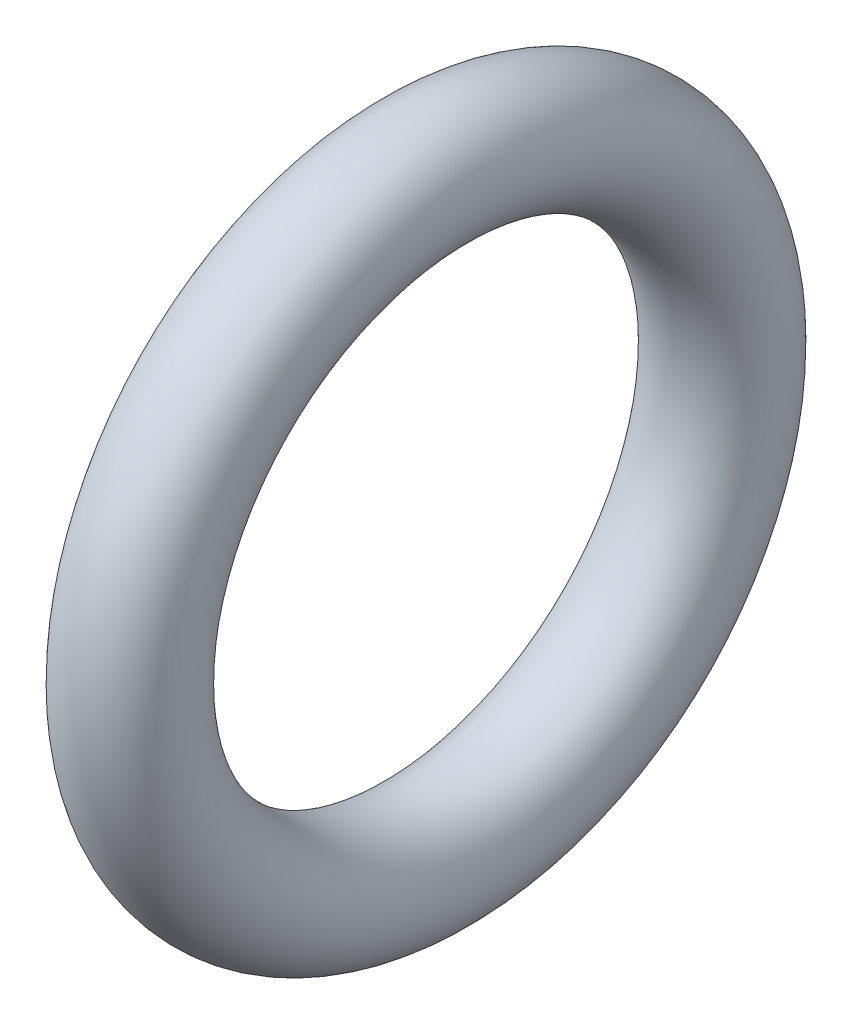
ISO-10303-21;
HEADER;
FILE_DESCRIPTION(('STEP AP214'),'2;1');
FILE_NAME('part.step','',(''),(''),'','','');
FILE_SCHEMA(('AUTOMOTIVE_DESIGN { 1 0 10303 214 1 1 1 1 }'));
ENDSEC;
DATA;
#1=APPLICATION_CONTEXT('core data for automotive mechanical design processes');
#2=APPLICATION_PROTOCOL_DEFINITION('international standard','automotive_design',2000,#1);
#3=PRODUCT_CONTEXT('',#1,'mechanical');
#4=PRODUCT('Part','Part','',(#3));
#5=PRODUCT_RELATED_PRODUCT_CATEGORY('part','',(#4));
#6=PRODUCT_DEFINITION_FORMATION('','',#4);
#7=PRODUCT_DEFINITION_CONTEXT('part definition',#1,'design');
#8=PRODUCT_DEFINITION('design','',#6,#7);
#9=PRODUCT_DEFINITION_SHAPE('','',#8);
#10=(LENGTH_UNIT() NAMED_UNIT(*) SI_UNIT(.MILLI.,.METRE.));
#11=(NAMED_UNIT(*) PLANE_ANGLE_UNIT() SI_UNIT($,.RADIAN.));
#12=(NAMED_UNIT(*) SI_UNIT($,.STERADIAN.) SOLID_ANGLE_UNIT());
#13=UNCERTAINTY_MEASURE_WITH_UNIT(LENGTH_MEASURE(1.E-05),#10,'distance_accuracy_value','');
#14=(GEOMETRIC_REPRESENTATION_CONTEXT(3) GLOBAL_UNCERTAINTY_ASSIGNED_CONTEXT((#13)) GLOBAL_UNIT_ASSIGNED_CONTEXT((#10,
#11,#12)) REPRESENTATION_CONTEXT('',''));
#15=CARTESIAN_POINT('',(0.,0.,0.));
#16=DIRECTION('',(0.,0.,1.));
#17=DIRECTION('',(1.,0.,0.));
#18=AXIS2_PLACEMENT_3D('',#15,#16,#17);
#19=CARTESIAN_POINT('',(0.,0.,0.));
#20=DIRECTION('',(-1.,0.,0.));
#21=DIRECTION('',(0.,0.,1.));
#22=AXIS2_PLACEMENT_3D('',#19,#20,#21);
#23=TOROIDAL_SURFACE('',#22,5.950625,1.190625);
#24=CARTESIAN_POINT('',(0.,0.,7.14125));
#25=VERTEX_POINT('',#24);
#26=VERTEX_LOOP('',#25);
#27=FACE_BOUND('',#26,.T.);
#28=ADVANCED_FACE('F356',(#27),#23,.T.);
#29=CLOSED_SHELL('',(#28));
#30=MANIFOLD_SOLID_BREP('B2',#29);
#31=ADVANCED_BREP_SHAPE_REPRESENTATION('',(#18,#30),#14);
#32=SHAPE_DEFINITION_REPRESENTATION(#9,#31);
ENDSEC;
END-ISO-10303-21;
